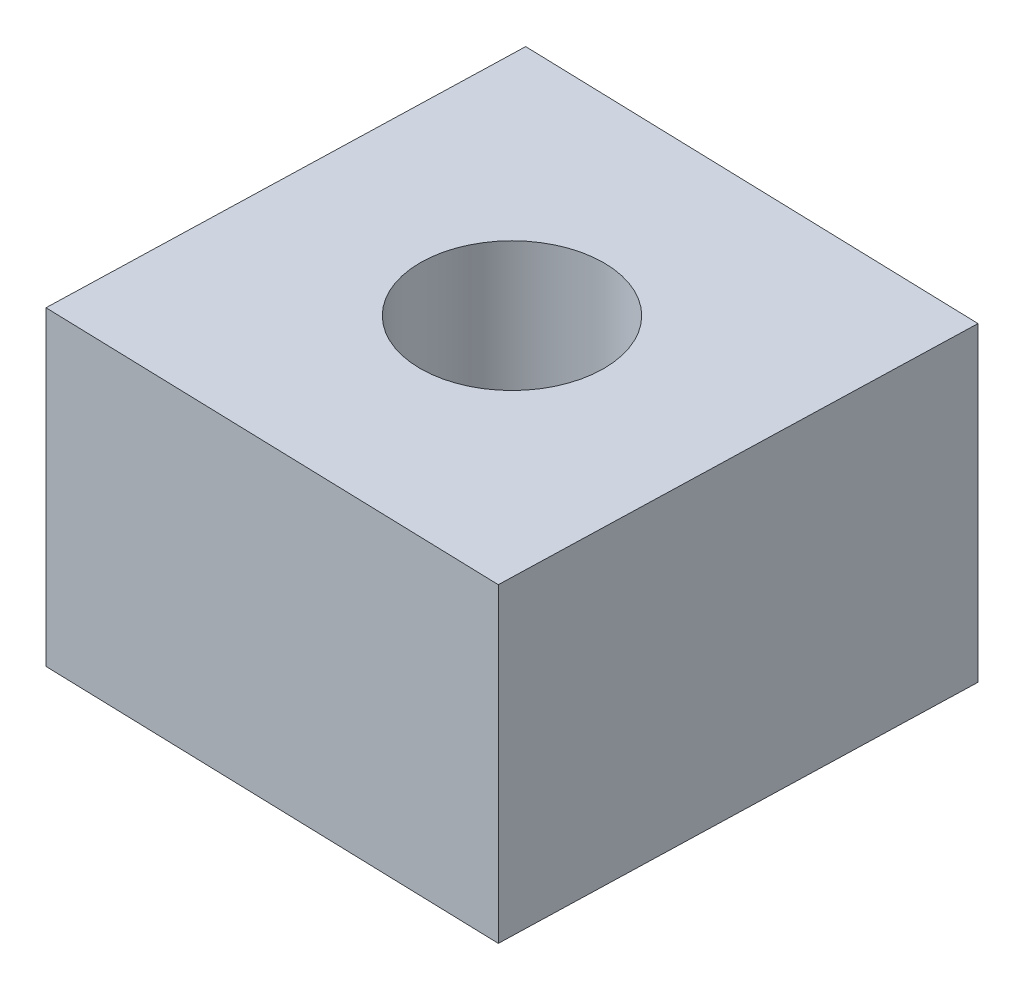
ISO-10303-21;
HEADER;
FILE_DESCRIPTION(('STEP AP214'),'2;1');
FILE_NAME('part.step','',(''),(''),'','','');
FILE_SCHEMA(('AUTOMOTIVE_DESIGN { 1 0 10303 214 1 1 1 1 }'));
ENDSEC;
DATA;
#1=APPLICATION_CONTEXT('core data for automotive mechanical design processes');
#2=APPLICATION_PROTOCOL_DEFINITION('international standard','automotive_design',2000,#1);
#3=PRODUCT_CONTEXT('',#1,'mechanical');
#4=PRODUCT('Part','Part','',(#3));
#5=PRODUCT_RELATED_PRODUCT_CATEGORY('part','',(#4));
#6=PRODUCT_DEFINITION_FORMATION('','',#4);
#7=PRODUCT_DEFINITION_CONTEXT('part definition',#1,'design');
#8=PRODUCT_DEFINITION('design','',#6,#7);
#9=PRODUCT_DEFINITION_SHAPE('','',#8);
#10=(LENGTH_UNIT() NAMED_UNIT(*) SI_UNIT(.MILLI.,.METRE.));
#11=(NAMED_UNIT(*) PLANE_ANGLE_UNIT() SI_UNIT($,.RADIAN.));
#12=(NAMED_UNIT(*) SI_UNIT($,.STERADIAN.) SOLID_ANGLE_UNIT());
#13=UNCERTAINTY_MEASURE_WITH_UNIT(LENGTH_MEASURE(1.E-05),#10,'distance_accuracy_value','');
#14=(GEOMETRIC_REPRESENTATION_CONTEXT(3) GLOBAL_UNCERTAINTY_ASSIGNED_CONTEXT((#13)) GLOBAL_UNIT_ASSIGNED_CONTEXT((#10,
#11,#12)) REPRESENTATION_CONTEXT('',''));
#15=CARTESIAN_POINT('',(0.,0.,0.));
#16=DIRECTION('',(0.,0.,1.));
#17=DIRECTION('',(1.,0.,0.));
#18=AXIS2_PLACEMENT_3D('',#15,#16,#17);
#19=CARTESIAN_POINT('',(0.112137091498611,5.08,-3.81));
#20=DIRECTION('',(-0.0294195677303244,0.,0.999567150838082));
#21=DIRECTION('',(0.999567150838082,0.,0.0294195677303244));
#22=AXIS2_PLACEMENT_3D('',#19,#20,#21);
#23=PLANE('',#22);
#24=DIRECTION('',(-0.999567150838082,0.,-0.0294195677303244));
#25=VECTOR('',#24,1.);
#26=CARTESIAN_POINT('',(0.112137091498611,0.,-3.81));
#27=LINE('',#26,#25);
#28=CARTESIAN_POINT('',(3.92213709149861,0.,-3.69786290850139));
#29=VERTEX_POINT('',#28);
#30=CARTESIAN_POINT('',(-3.69786290850139,0.,-3.92213709149861));
#31=VERTEX_POINT('',#30);
#32=EDGE_CURVE('E103',#29,#31,#27,.T.);
#33=ORIENTED_EDGE('',*,*,#32,.T.);
#34=DIRECTION('',(0.,-1.,0.));
#35=VECTOR('',#34,1.);
#36=CARTESIAN_POINT('',(-3.69786290850139,5.08,-3.92213709149861));
#37=LINE('',#36,#35);
#38=CARTESIAN_POINT('',(-3.69786290850139,5.08,-3.92213709149861));
#39=VERTEX_POINT('',#38);
#40=EDGE_CURVE('E11',#39,#31,#37,.T.);
#41=ORIENTED_EDGE('',*,*,#40,.F.);
#42=DIRECTION('',(-0.999567150838082,0.,-0.0294195677303244));
#43=VECTOR('',#42,1.);
#44=CARTESIAN_POINT('',(0.112137091498611,5.08,-3.81));
#45=LINE('',#44,#43);
#46=CARTESIAN_POINT('',(3.92213709149861,5.08,-3.69786290850139));
#47=VERTEX_POINT('',#46);
#48=EDGE_CURVE('E88',#47,#39,#45,.T.);
#49=ORIENTED_EDGE('',*,*,#48,.F.);
#50=DIRECTION('',(0.,-1.,0.));
#51=VECTOR('',#50,1.);
#52=CARTESIAN_POINT('',(3.92213709149861,5.08,-3.69786290850139));
#53=LINE('',#52,#51);
#54=EDGE_CURVE('E96',#47,#29,#53,.T.);
#55=ORIENTED_EDGE('',*,*,#54,.T.);
#56=EDGE_LOOP('',(#33,#41,#49,#55));
#57=FACE_BOUND('',#56,.T.);
#58=ADVANCED_FACE('F36',(#57),#23,.F.);
#59=CARTESIAN_POINT('',(-3.81,5.08,-0.112137091498612));
#60=DIRECTION('',(0.999567150838082,0.,0.0294195677303246));
#61=DIRECTION('',(0.0294195677303246,0.,-0.999567150838082));
#62=AXIS2_PLACEMENT_3D('',#59,#60,#61);
#63=PLANE('',#62);
#64=DIRECTION('',(-0.0294195677303246,0.,0.999567150838082));
#65=VECTOR('',#64,1.);
#66=CARTESIAN_POINT('',(-3.81,0.,-0.112137091498612));
#67=LINE('',#66,#65);
#68=CARTESIAN_POINT('',(-3.92213709149861,0.,3.69786290850139));
#69=VERTEX_POINT('',#68);
#70=EDGE_CURVE('E92',#31,#69,#67,.T.);
#71=ORIENTED_EDGE('',*,*,#70,.T.);
#72=DIRECTION('',(0.,-1.,0.));
#73=VECTOR('',#72,1.);
#74=CARTESIAN_POINT('',(-3.92213709149861,5.08,3.69786290850139));
#75=LINE('',#74,#73);
#76=CARTESIAN_POINT('',(-3.92213709149861,5.08,3.69786290850139));
#77=VERTEX_POINT('',#76);
#78=EDGE_CURVE('E45',#77,#69,#75,.T.);
#79=ORIENTED_EDGE('',*,*,#78,.F.);
#80=DIRECTION('',(-0.0294195677303246,0.,0.999567150838082));
#81=VECTOR('',#80,1.);
#82=CARTESIAN_POINT('',(-3.81,5.08,-0.112137091498612));
#83=LINE('',#82,#81);
#84=EDGE_CURVE('E83',#39,#77,#83,.T.);
#85=ORIENTED_EDGE('',*,*,#84,.F.);
#86=ORIENTED_EDGE('',*,*,#40,.T.);
#87=EDGE_LOOP('',(#71,#79,#85,#86));
#88=FACE_BOUND('',#87,.T.);
#89=ADVANCED_FACE('F91',(#88),#63,.F.);
#90=CARTESIAN_POINT('',(-0.112137091498611,5.08,3.81));
#91=DIRECTION('',(0.0294195677303243,0.,-0.999567150838082));
#92=DIRECTION('',(-0.999567150838082,0.,-0.0294195677303243));
#93=AXIS2_PLACEMENT_3D('',#90,#91,#92);
#94=PLANE('',#93);
#95=DIRECTION('',(0.999567150838082,0.,0.0294195677303243));
#96=VECTOR('',#95,1.);
#97=CARTESIAN_POINT('',(-0.112137091498611,0.,3.81));
#98=LINE('',#97,#96);
#99=CARTESIAN_POINT('',(3.69786290850139,0.,3.92213709149861));
#100=VERTEX_POINT('',#99);
#101=EDGE_CURVE('E70',#69,#100,#98,.T.);
#102=ORIENTED_EDGE('',*,*,#101,.T.);
#103=DIRECTION('',(0.,-1.,0.));
#104=VECTOR('',#103,1.);
#105=CARTESIAN_POINT('',(3.69786290850139,5.08,3.92213709149861));
#106=LINE('',#105,#104);
#107=CARTESIAN_POINT('',(3.69786290850139,5.08,3.92213709149861));
#108=VERTEX_POINT('',#107);
#109=EDGE_CURVE('E93',#108,#100,#106,.T.);
#110=ORIENTED_EDGE('',*,*,#109,.F.);
#111=DIRECTION('',(0.999567150838082,0.,0.0294195677303243));
#112=VECTOR('',#111,1.);
#113=CARTESIAN_POINT('',(-0.112137091498611,5.08,3.81));
#114=LINE('',#113,#112);
#115=EDGE_CURVE('E86',#77,#108,#114,.T.);
#116=ORIENTED_EDGE('',*,*,#115,.F.);
#117=ORIENTED_EDGE('',*,*,#78,.T.);
#118=EDGE_LOOP('',(#102,#110,#116,#117));
#119=FACE_BOUND('',#118,.T.);
#120=ADVANCED_FACE('F94',(#119),#94,.F.);
#121=CARTESIAN_POINT('',(0.,5.08,0.));
#122=DIRECTION('',(0.,-1.,0.));
#123=DIRECTION('',(0.,0.,-1.));
#124=AXIS2_PLACEMENT_3D('',#121,#122,#123);
#125=CYLINDRICAL_SURFACE('',#124,1.5);
#126=CARTESIAN_POINT('',(0.,5.08,0.));
#127=DIRECTION('',(0.,1.,0.));
#128=DIRECTION('',(0.,0.,1.));
#129=AXIS2_PLACEMENT_3D('',#126,#127,#128);
#130=CIRCLE('',#129,1.5);
#131=CARTESIAN_POINT('',(0.,5.08,1.5));
#132=VERTEX_POINT('',#131);
#133=EDGE_CURVE('E109',#132,#132,#130,.T.);
#134=ORIENTED_EDGE('',*,*,#133,.T.);
#135=EDGE_LOOP('',(#134));
#136=FACE_BOUND('',#135,.T.);
#137=CARTESIAN_POINT('',(0.,0.,0.));
#138=DIRECTION('',(0.,1.,0.));
#139=DIRECTION('',(0.,0.,1.));
#140=AXIS2_PLACEMENT_3D('',#137,#138,#139);
#141=CIRCLE('',#140,1.5);
#142=CARTESIAN_POINT('',(0.,0.,1.5));
#143=VERTEX_POINT('',#142);
#144=EDGE_CURVE('E100',#143,#143,#141,.T.);
#145=ORIENTED_EDGE('',*,*,#144,.F.);
#146=EDGE_LOOP('',(#145));
#147=FACE_BOUND('',#146,.T.);
#148=ADVANCED_FACE('F38',(#136,#147),#125,.F.);
#149=CARTESIAN_POINT('',(3.81,5.08,0.112137091498611));
#150=DIRECTION('',(-0.999567150838082,0.,-0.0294195677303244));
#151=DIRECTION('',(-0.0294195677303244,0.,0.999567150838082));
#152=AXIS2_PLACEMENT_3D('',#149,#150,#151);
#153=PLANE('',#152);
#154=DIRECTION('',(0.0294195677303244,0.,-0.999567150838082));
#155=VECTOR('',#154,1.);
#156=CARTESIAN_POINT('',(3.81,0.,0.112137091498611));
#157=LINE('',#156,#155);
#158=EDGE_CURVE('E76',#100,#29,#157,.T.);
#159=ORIENTED_EDGE('',*,*,#158,.T.);
#160=ORIENTED_EDGE('',*,*,#54,.F.);
#161=DIRECTION('',(0.0294195677303244,0.,-0.999567150838082));
#162=VECTOR('',#161,1.);
#163=CARTESIAN_POINT('',(3.81,5.08,0.112137091498611));
#164=LINE('',#163,#162);
#165=EDGE_CURVE('E53',#108,#47,#164,.T.);
#166=ORIENTED_EDGE('',*,*,#165,.F.);
#167=ORIENTED_EDGE('',*,*,#109,.T.);
#168=EDGE_LOOP('',(#159,#160,#166,#167));
#169=FACE_BOUND('',#168,.T.);
#170=ADVANCED_FACE('F111',(#169),#153,.F.);
#171=CARTESIAN_POINT('',(0.,5.08,0.));
#172=DIRECTION('',(0.,1.,0.));
#173=DIRECTION('',(0.,0.,1.));
#174=AXIS2_PLACEMENT_3D('',#171,#172,#173);
#175=PLANE('',#174);
#176=ORIENTED_EDGE('',*,*,#133,.F.);
#177=EDGE_LOOP('',(#176));
#178=FACE_BOUND('',#177,.T.);
#179=ORIENTED_EDGE('',*,*,#48,.T.);
#180=ORIENTED_EDGE('',*,*,#84,.T.);
#181=ORIENTED_EDGE('',*,*,#115,.T.);
#182=ORIENTED_EDGE('',*,*,#165,.T.);
#183=EDGE_LOOP('',(#179,#180,#181,#182));
#184=FACE_BOUND('',#183,.T.);
#185=ADVANCED_FACE('F84',(#178,#184),#175,.T.);
#186=CARTESIAN_POINT('',(0.,0.,0.));
#187=DIRECTION('',(0.,1.,0.));
#188=DIRECTION('',(0.,0.,1.));
#189=AXIS2_PLACEMENT_3D('',#186,#187,#188);
#190=PLANE('',#189);
#191=ORIENTED_EDGE('',*,*,#144,.T.);
#192=EDGE_LOOP('',(#191));
#193=FACE_BOUND('',#192,.T.);
#194=ORIENTED_EDGE('',*,*,#32,.F.);
#195=ORIENTED_EDGE('',*,*,#158,.F.);
#196=ORIENTED_EDGE('',*,*,#101,.F.);
#197=ORIENTED_EDGE('',*,*,#70,.F.);
#198=EDGE_LOOP('',(#194,#195,#196,#197));
#199=FACE_BOUND('',#198,.T.);
#200=ADVANCED_FACE('F114',(#193,#199),#190,.F.);
#201=CLOSED_SHELL('',(#58,#89,#120,#148,#170,#185,#200));
#202=MANIFOLD_SOLID_BREP('B2',#201);
#203=ADVANCED_BREP_SHAPE_REPRESENTATION('',(#18,#202),#14);
#204=SHAPE_DEFINITION_REPRESENTATION(#9,#203);
ENDSEC;
END-ISO-10303-21;
